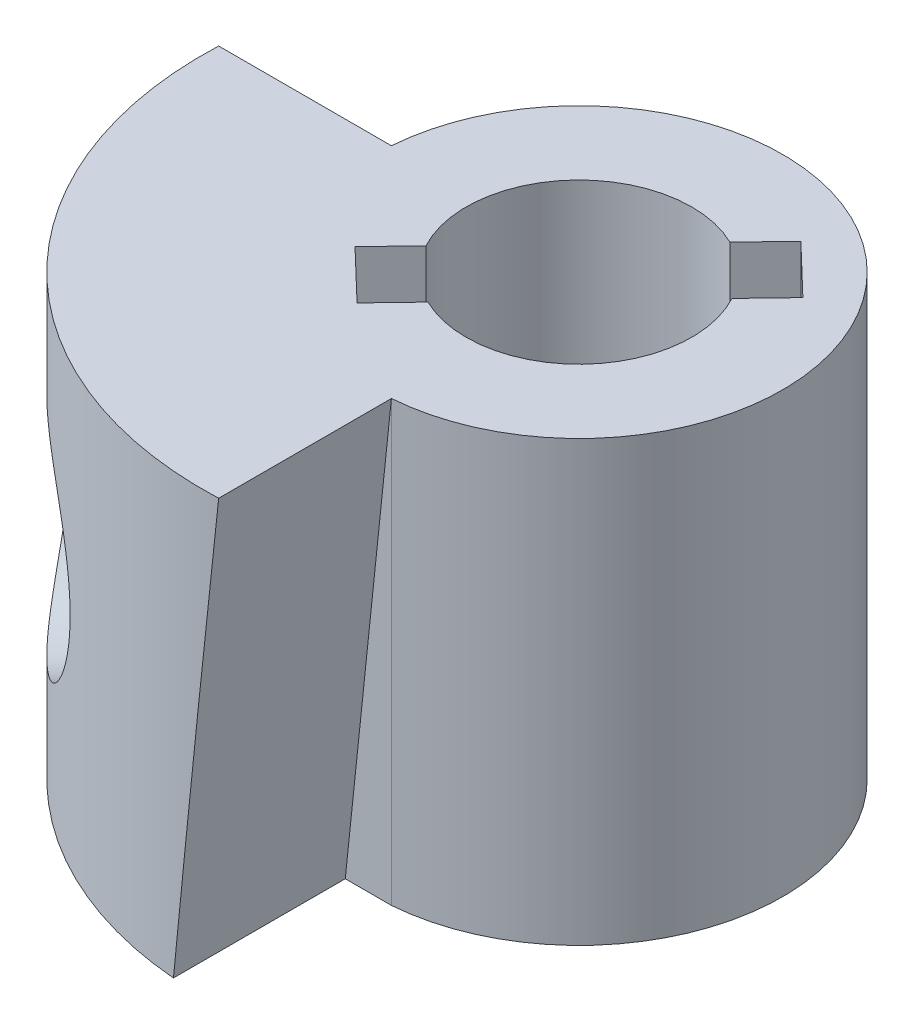
ISO-10303-21;
HEADER;
FILE_DESCRIPTION(('STEP AP214'),'2;1');
FILE_NAME('part.step','',(''),(''),'','','');
FILE_SCHEMA(('AUTOMOTIVE_DESIGN { 1 0 10303 214 1 1 1 1 }'));
ENDSEC;
DATA;
#1=APPLICATION_CONTEXT('core data for automotive mechanical design processes');
#2=APPLICATION_PROTOCOL_DEFINITION('international standard','automotive_design',2000,#1);
#3=PRODUCT_CONTEXT('',#1,'mechanical');
#4=PRODUCT('Part','Part','',(#3));
#5=PRODUCT_RELATED_PRODUCT_CATEGORY('part','',(#4));
#6=PRODUCT_DEFINITION_FORMATION('','',#4);
#7=PRODUCT_DEFINITION_CONTEXT('part definition',#1,'design');
#8=PRODUCT_DEFINITION('design','',#6,#7);
#9=PRODUCT_DEFINITION_SHAPE('','',#8);
#10=(LENGTH_UNIT() NAMED_UNIT(*) SI_UNIT(.MILLI.,.METRE.));
#11=(NAMED_UNIT(*) PLANE_ANGLE_UNIT() SI_UNIT($,.RADIAN.));
#12=(NAMED_UNIT(*) SI_UNIT($,.STERADIAN.) SOLID_ANGLE_UNIT());
#13=UNCERTAINTY_MEASURE_WITH_UNIT(LENGTH_MEASURE(1.E-05),#10,'distance_accuracy_value','');
#14=(GEOMETRIC_REPRESENTATION_CONTEXT(3) GLOBAL_UNCERTAINTY_ASSIGNED_CONTEXT((#13)) GLOBAL_UNIT_ASSIGNED_CONTEXT((#10,
#11,#12)) REPRESENTATION_CONTEXT('',''));
#15=CARTESIAN_POINT('',(0.,0.,0.));
#16=DIRECTION('',(0.,0.,1.));
#17=DIRECTION('',(1.,0.,0.));
#18=AXIS2_PLACEMENT_3D('',#15,#16,#17);
#19=CARTESIAN_POINT('',(0.,0.,0.));
#20=DIRECTION('',(0.,1.,0.));
#21=DIRECTION('',(0.,0.,1.));
#22=AXIS2_PLACEMENT_3D('',#19,#20,#21);
#23=PLANE('',#22);
#24=CARTESIAN_POINT('',(3.1978546756018,0.,-6.44686874327543));
#25=DIRECTION('',(0.,1.,0.));
#26=DIRECTION('',(0.,0.,1.));
#27=AXIS2_PLACEMENT_3D('',#24,#25,#26);
#28=CIRCLE('',#27,6.);
#29=CARTESIAN_POINT('',(2.71212502874212,0.,-0.4665621700167));
#30=VERTEX_POINT('',#29);
#31=CARTESIAN_POINT('',(-2.75710614179532,0.,-5.71308290035869));
#32=VERTEX_POINT('',#31);
#33=EDGE_CURVE('E190',#30,#32,#28,.F.);
#34=ORIENTED_EDGE('',*,*,#33,.T.);
#35=DIRECTION('',(1.,0.,0.));
#36=VECTOR('',#35,1.);
#37=CARTESIAN_POINT('',(-3.7969347285391,0.,-5.71308290035869));
#38=LINE('',#37,#36);
#39=CARTESIAN_POINT('',(-0.0425156736021293,0.,-5.71308290035869));
#40=VERTEX_POINT('',#39);
#41=EDGE_CURVE('E271',#32,#40,#38,.T.);
#42=ORIENTED_EDGE('',*,*,#41,.T.);
#43=DIRECTION('',(0.,0.,-1.));
#44=VECTOR('',#43,1.);
#45=CARTESIAN_POINT('',(-0.0425156736021293,0.,-6.69686874327543));
#46=LINE('',#45,#44);
#47=CARTESIAN_POINT('',(-0.0425156736021293,0.,-6.69686874327543));
#48=VERTEX_POINT('',#47);
#49=EDGE_CURVE('E233',#40,#48,#46,.T.);
#50=ORIENTED_EDGE('',*,*,#49,.T.);
#51=CARTESIAN_POINT('',(3.1978546756018,0.,-6.44686874327543));
#52=DIRECTION('',(0.,1.,0.));
#53=DIRECTION('',(0.,0.,1.));
#54=AXIS2_PLACEMENT_3D('',#51,#52,#53);
#55=CIRCLE('',#54,3.25);
#56=CARTESIAN_POINT('',(3.4478546756018,0.,-3.2064983940715));
#57=VERTEX_POINT('',#56);
#58=EDGE_CURVE('E195',#57,#48,#55,.T.);
#59=ORIENTED_EDGE('',*,*,#58,.F.);
#60=DIRECTION('',(1.,0.,0.));
#61=VECTOR('',#60,1.);
#62=CARTESIAN_POINT('',(3.4478546756018,0.,-3.2064983940715));
#63=LINE('',#62,#61);
#64=CARTESIAN_POINT('',(2.71212502874212,0.,-3.2064983940715));
#65=VERTEX_POINT('',#64);
#66=EDGE_CURVE('E277',#65,#57,#63,.T.);
#67=ORIENTED_EDGE('',*,*,#66,.F.);
#68=DIRECTION('',(0.,0.,-1.));
#69=VECTOR('',#68,1.);
#70=CARTESIAN_POINT('',(2.71212502874212,0.,0.));
#71=LINE('',#70,#69);
#72=EDGE_CURVE('E221',#30,#65,#71,.T.);
#73=ORIENTED_EDGE('',*,*,#72,.F.);
#74=EDGE_LOOP('',(#34,#42,#50,#59,#67,#73));
#75=FACE_BOUND('',#74,.T.);
#76=CARTESIAN_POINT('',(3.1978546756018,0.,-6.44686874327543));
#77=DIRECTION('',(0.,1.,0.));
#78=DIRECTION('',(0.,0.,1.));
#79=AXIS2_PLACEMENT_3D('',#76,#77,#78);
#80=CIRCLE('',#79,1.8);
#81=CARTESIAN_POINT('',(3.98742463542605,0.,-8.06445313938685));
#82=VERTEX_POINT('',#81);
#83=CARTESIAN_POINT('',(1.61447294149998,0.,-5.59077162021479));
#84=VERTEX_POINT('',#83);
#85=EDGE_CURVE('E214',#82,#84,#80,.T.);
#86=ORIENTED_EDGE('',*,*,#85,.T.);
#87=DIRECTION('',(0.692261157318882,0.,-0.721647067525062));
#88=VECTOR('',#87,1.);
#89=CARTESIAN_POINT('',(-1.95219558295705,0.,-1.87270098416041));
#90=LINE('',#89,#88);
#91=CARTESIAN_POINT('',(1.06066401564487,0.,-5.01345396619473));
#92=VERTEX_POINT('',#91);
#93=EDGE_CURVE('E170',#92,#84,#90,.T.);
#94=ORIENTED_EDGE('',*,*,#93,.F.);
#95=DIRECTION('',(-0.721647067525063,0.,-0.692261157318882));
#96=VECTOR('',#95,1.);
#97=CARTESIAN_POINT('',(3.01285959860192,0.,-3.14075298203433));
#98=LINE('',#97,#96);
#99=CARTESIAN_POINT('',(1.85447578992245,0.,-4.25196669314396));
#100=VERTEX_POINT('',#99);
#101=EDGE_CURVE('E608',#100,#92,#98,.T.);
#102=ORIENTED_EDGE('',*,*,#101,.F.);
#103=DIRECTION('',(-0.692261157318881,0.,0.721647067525063));
#104=VECTOR('',#103,1.);
#105=CARTESIAN_POINT('',(-1.15838380867947,0.,-1.11121371110963));
#106=LINE('',#105,#104);
#107=CARTESIAN_POINT('',(2.40828471577755,0.,-4.82928434716401));
#108=VERTEX_POINT('',#107);
#109=EDGE_CURVE('E566',#108,#100,#106,.T.);
#110=ORIENTED_EDGE('',*,*,#109,.F.);
#111=CARTESIAN_POINT('',(4.78123640970362,0.,-7.30296586633608));
#112=VERTEX_POINT('',#111);
#113=EDGE_CURVE('E211',#108,#112,#80,.T.);
#114=ORIENTED_EDGE('',*,*,#113,.T.);
#115=DIRECTION('',(0.692261157318882,0.,-0.721647067525062));
#116=VECTOR('',#115,1.);
#117=CARTESIAN_POINT('',(-1.15838380867948,0.,-1.11121371110964));
#118=LINE('',#117,#116);
#119=CARTESIAN_POINT('',(5.33504533555872,0.,-7.88028352035612));
#120=VERTEX_POINT('',#119);
#121=EDGE_CURVE('E552',#112,#120,#118,.T.);
#122=ORIENTED_EDGE('',*,*,#121,.T.);
#123=DIRECTION('',(-0.72164706752506,0.,-0.692261157318884));
#124=VECTOR('',#123,1.);
#125=CARTESIAN_POINT('',(6.49342914423822,0.,-6.76906980924646));
#126=LINE('',#125,#124);
#127=CARTESIAN_POINT('',(4.54123356128116,0.,-8.6417707934069));
#128=VERTEX_POINT('',#127);
#129=EDGE_CURVE('E546',#120,#128,#126,.T.);
#130=ORIENTED_EDGE('',*,*,#129,.T.);
#131=DIRECTION('',(-0.692261157318882,0.,0.721647067525063));
#132=VECTOR('',#131,1.);
#133=CARTESIAN_POINT('',(-1.95219558295705,0.,-1.8727009841604));
#134=LINE('',#133,#132);
#135=EDGE_CURVE('E553',#128,#82,#134,.T.);
#136=ORIENTED_EDGE('',*,*,#135,.T.);
#137=EDGE_LOOP('',(#86,#94,#102,#110,#114,#122,#130,#136));
#138=FACE_BOUND('',#137,.T.);
#139=ADVANCED_FACE('F39',(#75,#138),#23,.F.);
#140=CARTESIAN_POINT('',(3.1978546756018,7.,-6.44686874327543));
#141=DIRECTION('',(0.,-1.,0.));
#142=DIRECTION('',(0.,0.,-1.));
#143=AXIS2_PLACEMENT_3D('',#140,#141,#142);
#144=CYLINDRICAL_SURFACE('',#143,1.8);
#145=DIRECTION('',(0.,-1.,0.));
#146=VECTOR('',#145,1.);
#147=CARTESIAN_POINT('',(1.61447294149998,7.,-5.59077162021479));
#148=LINE('',#147,#146);
#149=CARTESIAN_POINT('',(1.61447294149998,2.68434316709461,-5.59077162021479));
#150=VERTEX_POINT('',#149);
#151=EDGE_CURVE('E577',#150,#84,#148,.T.);
#152=ORIENTED_EDGE('',*,*,#151,.T.);
#153=ORIENTED_EDGE('',*,*,#85,.F.);
#154=DIRECTION('',(0.,-1.,0.));
#155=VECTOR('',#154,1.);
#156=CARTESIAN_POINT('',(3.98742463542605,7.,-8.06445313938685));
#157=LINE('',#156,#155);
#158=CARTESIAN_POINT('',(3.98742463542605,7.,-8.06445313938685));
#159=VERTEX_POINT('',#158);
#160=EDGE_CURVE('E564',#159,#82,#157,.T.);
#161=ORIENTED_EDGE('',*,*,#160,.F.);
#162=CARTESIAN_POINT('',(3.1978546756018,7.,-6.44686874327543));
#163=DIRECTION('',(0.,1.,0.));
#164=DIRECTION('',(0.,0.,1.));
#165=AXIS2_PLACEMENT_3D('',#162,#163,#164);
#166=CIRCLE('',#165,1.8);
#167=CARTESIAN_POINT('',(1.61447294149998,7.,-5.59077162021479));
#168=VERTEX_POINT('',#167);
#169=EDGE_CURVE('E189',#159,#168,#166,.T.);
#170=ORIENTED_EDGE('',*,*,#169,.T.);
#171=CARTESIAN_POINT('',(1.61447294149998,4.3156568329054,-5.59077162021479));
#172=VERTEX_POINT('',#171);
#173=EDGE_CURVE('E572',#168,#172,#148,.T.);
#174=ORIENTED_EDGE('',*,*,#173,.T.);
#175=CARTESIAN_POINT('',(2.58593626434302,3.5,-4.75407346387437));
#176=CARTESIAN_POINT('',(2.58593165890067,3.45164209567553,-4.75407304253641));
#177=CARTESIAN_POINT('',(2.58189518822979,3.40322669557676,-4.75551743004544));
#178=CARTESIAN_POINT('',(2.56604689302456,3.30781980538129,-4.76137584568503));
#179=CARTESIAN_POINT('',(2.55421983771715,3.26083129351047,-4.76579569127817));
#180=CARTESIAN_POINT('',(2.52369222374452,3.16978646138646,-4.77780592866989));
#181=CARTESIAN_POINT('',(2.5050177543581,3.12571975162445,-4.78538430097502));
#182=CARTESIAN_POINT('',(2.46190275726425,3.04132444139148,-4.80402837477698));
#183=CARTESIAN_POINT('',(2.43746217748379,3.00099587468382,-4.81509410776802));
#184=CARTESIAN_POINT('',(2.38253180949395,2.92277910530327,-4.84180486423292));
#185=CARTESIAN_POINT('',(2.35178356271122,2.88514647255107,-4.85766795969881));
#186=CARTESIAN_POINT('',(2.28660946116589,2.81579594789013,-4.89412119419213));
#187=CARTESIAN_POINT('',(2.25218282067698,2.78407932366381,-4.91471234424314));
#188=CARTESIAN_POINT('',(2.18036583194011,2.72683694507191,-4.96141006006465));
#189=CARTESIAN_POINT('',(2.14292760750474,2.70145931333166,-4.98762590827676));
#190=CARTESIAN_POINT('',(2.06747934349972,2.65874518423221,-5.04526320224414));
#191=CARTESIAN_POINT('',(2.02946972323656,2.64140306165042,-5.07668098543121));
#192=CARTESIAN_POINT('',(1.95747843572969,2.61644399113628,-5.14163430969477));
#193=CARTESIAN_POINT('',(1.92340984082619,2.60818951007556,-5.17482880316509));
#194=CARTESIAN_POINT('',(1.85759237638962,2.5993885241676,-5.24437709028566));
#195=CARTESIAN_POINT('',(1.82584282218836,2.59883973508447,-5.28072994447232));
#196=CARTESIAN_POINT('',(1.76729303187841,2.60511955998636,-5.35345273840576));
#197=CARTESIAN_POINT('',(1.74031920572765,2.61155657178351,-5.38971852193239));
#198=CARTESIAN_POINT('',(1.68988787715863,2.63078373203864,-5.4629907195175));
#199=CARTESIAN_POINT('',(1.66643107954017,2.6435751516877,-5.49999728034536));
#200=CARTESIAN_POINT('',(1.6221058536884,2.67578231161031,-5.57564101172271));
#201=CARTESIAN_POINT('',(1.60143812627157,2.6955107381739,-5.61426171910763));
#202=CARTESIAN_POINT('',(1.56414372744641,2.74072421621793,-5.6900493448843));
#203=CARTESIAN_POINT('',(1.54751882365155,2.76621177635935,-5.72721562142856));
#204=CARTESIAN_POINT('',(1.51627171011049,2.82570043316487,-5.80331319402689));
#205=CARTESIAN_POINT('',(1.5021215466589,2.86035301070488,-5.84193023363628));
#206=CARTESIAN_POINT('',(1.47793807132945,2.93552420798308,-5.91455753528682));
#207=CARTESIAN_POINT('',(1.4679097259891,2.97604982534678,-5.94856220686187));
#208=CARTESIAN_POINT('',(1.45086159076688,3.06485794555923,-6.01195229026397));
#209=CARTESIAN_POINT('',(1.44404636057603,3.11345129266112,-6.04096292036509));
#210=CARTESIAN_POINT('',(1.4335506068992,3.21552216811336,-6.08930537082033));
#211=CARTESIAN_POINT('',(1.42986287060364,3.26898814152932,-6.10865941903924));
#212=CARTESIAN_POINT('',(1.425317058196,3.37125681986916,-6.13342305703632));
#213=CARTESIAN_POINT('',(1.42413417624729,3.41965907769657,-6.14040995745534));
#214=CARTESIAN_POINT('',(1.42341215773127,3.51688599288063,-6.14460821931317));
#215=CARTESIAN_POINT('',(1.42387168901975,3.56571027588346,-6.14182750319509));
#216=CARTESIAN_POINT('',(1.42630748441873,3.65438851618388,-6.12803527157906));
#217=CARTESIAN_POINT('',(1.42803958521473,3.69446712608628,-6.11835553809088));
#218=CARTESIAN_POINT('',(1.43292044598403,3.77261191084303,-6.09307172218272));
#219=CARTESIAN_POINT('',(1.43606977202725,3.81067727476814,-6.07746527289553));
#220=CARTESIAN_POINT('',(1.44436433785688,3.88712362440158,-6.03984329495438));
#221=CARTESIAN_POINT('',(1.44964978000072,3.92528357984879,-6.01741312686864));
#222=CARTESIAN_POINT('',(1.46254521585249,3.99806299434809,-5.96795893948852));
#223=CARTESIAN_POINT('',(1.47015651151187,4.03268045588064,-5.9409323510064));
#224=CARTESIAN_POINT('',(1.48977280538416,4.10419236669426,-5.87788792990748));
#225=CARTESIAN_POINT('',(1.50233503053165,4.14028979442872,-5.84113514341304));
#226=CARTESIAN_POINT('',(1.5318694500142,4.20643596571868,-5.76408186939672));
#227=CARTESIAN_POINT('',(1.54884482629075,4.23648031706685,-5.72377883601885));
#228=CARTESIAN_POINT('',(1.58906121385059,4.29168195925882,-5.6380553166008));
#229=CARTESIAN_POINT('',(1.61266435409063,4.31633402951735,-5.59247512890515));
#230=CARTESIAN_POINT('',(1.66566450826141,4.35669317230296,-5.50072385364523));
#231=CARTESIAN_POINT('',(1.69505607083561,4.37240860735328,-5.45455335997765));
#232=CARTESIAN_POINT('',(1.75616189589581,4.39283454357759,-5.36795308129152));
#233=CARTESIAN_POINT('',(1.78738993676058,4.39844899221216,-5.3273947351398));
#234=CARTESIAN_POINT('',(1.85336554362842,4.4009890764757,-5.24896725790613));
#235=CARTESIAN_POINT('',(1.88811070584326,4.39792060832638,-5.21109631981743));
#236=CARTESIAN_POINT('',(1.9560854793894,4.38383684485589,-5.14299437851764));
#237=CARTESIAN_POINT('',(1.98910828587971,4.37366390002721,-5.11237810969817));
#238=CARTESIAN_POINT('',(2.05570640540849,4.34661984929305,-5.05495252931959));
#239=CARTESIAN_POINT('',(2.08928173970136,4.32974848513566,-5.0281433645943));
#240=CARTESIAN_POINT('',(2.15604257981551,4.28967938394721,-4.97840788278078));
#241=CARTESIAN_POINT('',(2.18922238660323,4.26642934564628,-4.95551632450452));
#242=CARTESIAN_POINT('',(2.25371670332376,4.21431991579325,-4.91387192484171));
#243=CARTESIAN_POINT('',(2.28503061013679,4.18545872324531,-4.8951204164128));
#244=CARTESIAN_POINT('',(2.34711111304475,4.12022513267222,-4.86017205225501));
#245=CARTESIAN_POINT('',(2.37762382947284,4.08343164168241,-4.84430922221613));
#246=CARTESIAN_POINT('',(2.43380434392032,4.00486235528098,-4.81677406662317));
#247=CARTESIAN_POINT('',(2.45946837662002,3.9630827285543,-4.80510499150106));
#248=CARTESIAN_POINT('',(2.50555870135343,3.87357196165791,-4.78512685302997));
#249=CARTESIAN_POINT('',(2.52571163785091,3.8256619419721,-4.77698424477482));
#250=CARTESIAN_POINT('',(2.55779122805544,3.72677338472121,-4.76442358829717));
#251=CARTESIAN_POINT('',(2.56973914450205,3.67580315352015,-4.75999590643936));
#252=CARTESIAN_POINT('',(2.58003963849306,3.60361561655101,-4.75621462103034));
#253=CARTESIAN_POINT('',(2.58224645603788,3.58296609919506,-4.7554110909343));
#254=CARTESIAN_POINT('',(2.58519577874893,3.54154792875828,-4.75434059543721));
#255=CARTESIAN_POINT('',(2.58593824329025,3.52077927238826,-4.75407364492225));
#256=CARTESIAN_POINT('',(2.58593626434302,3.5,-4.75407346387437));
#257=B_SPLINE_CURVE_WITH_KNOTS('',3,(#175,#176,#177,#178,#179,#180,#181,#182,#183,#184,#185,
#186,#187,#188,#189,#190,#191,#192,#193,#194,#195,#196,#197,#198,#199,#200,#201,#202,#203,#204,
#205,#206,#207,#208,#209,#210,#211,#212,#213,#214,#215,#216,#217,#218,#219,#220,#221,#222,#223,
#224,#225,#226,#227,#228,#229,#230,#231,#232,#233,#234,#235,#236,#237,#238,#239,#240,#241,#242,
#243,#244,#245,#246,#247,#248,#249,#250,#251,#252,#253,#254,#255,#256),.UNSPECIFIED.,.T.,.F.,(4,
2,2,2,2,2,2,2,2,2,2,2,2,2,2,2,2,2,2,2,2,2,2,2,2,2,2,2,2,2,2,2,2,2,2,2,2,2,2,2,4),(0.,
0.144990043783322,0.290264391114628,0.434990885686945,0.579718687316227,0.732392956177553,
0.8850999025959,1.04109728162934,1.1969852897815,1.34105684449336,1.48508569046908,
1.62143886843484,1.75781933466851,1.90136405746522,2.04497142885722,2.20562708960415,
2.36647576702449,2.53651179476386,2.7061546007186,2.8519592420929,2.99764564969445,
3.12092374360412,3.24425112117317,3.37750136000473,3.51082632586766,3.66923593789059,
3.82776008368537,3.99765667891288,4.16739402940341,4.32099975785357,4.47450120382963,
4.61234819214932,4.7502004955599,4.88921874799706,5.02828169460252,5.17870970479738,
5.32925405628246,5.48628555882566,5.64290857376971,5.70520871014841,5.76751057486826),.UNSPECIFIED.);
#258=EDGE_CURVE('E234',#150,#172,#257,.T.);
#259=ORIENTED_EDGE('',*,*,#258,.F.);
#260=EDGE_LOOP('',(#152,#153,#161,#170,#174,#259));
#261=FACE_BOUND('',#260,.T.);
#262=ADVANCED_FACE('F41',(#261),#144,.F.);
#263=DIRECTION('',(0.,-1.,0.));
#264=VECTOR('',#263,1.);
#265=CARTESIAN_POINT('',(2.40828471577755,7.,-4.82928434716401));
#266=LINE('',#265,#264);
#267=CARTESIAN_POINT('',(2.40828471577755,7.,-4.82928434716401));
#268=VERTEX_POINT('',#267);
#269=CARTESIAN_POINT('',(2.40828471577756,4.04053534302425,-4.82928434716401));
#270=VERTEX_POINT('',#269);
#271=EDGE_CURVE('E161',#268,#270,#266,.T.);
#272=ORIENTED_EDGE('',*,*,#271,.F.);
#273=CARTESIAN_POINT('',(4.78123640970362,7.,-7.30296586633608));
#274=VERTEX_POINT('',#273);
#275=EDGE_CURVE('E177',#268,#274,#166,.T.);
#276=ORIENTED_EDGE('',*,*,#275,.T.);
#277=DIRECTION('',(0.,-1.,0.));
#278=VECTOR('',#277,1.);
#279=CARTESIAN_POINT('',(4.78123640970362,7.,-7.30296586633608));
#280=LINE('',#279,#278);
#281=EDGE_CURVE('E567',#274,#112,#280,.T.);
#282=ORIENTED_EDGE('',*,*,#281,.T.);
#283=ORIENTED_EDGE('',*,*,#113,.F.);
#284=CARTESIAN_POINT('',(2.40828471577755,2.95946465697574,-4.82928434716401));
#285=VERTEX_POINT('',#284);
#286=EDGE_CURVE('E181',#285,#108,#266,.T.);
#287=ORIENTED_EDGE('',*,*,#286,.F.);
#288=EDGE_CURVE('E180',#270,#285,#257,.T.);
#289=ORIENTED_EDGE('',*,*,#288,.F.);
#290=EDGE_LOOP('',(#272,#276,#282,#283,#287,#289));
#291=FACE_BOUND('',#290,.T.);
#292=ADVANCED_FACE('F175',(#291),#144,.F.);
#293=CARTESIAN_POINT('',(0.,7.,0.));
#294=DIRECTION('',(0.,1.,0.));
#295=DIRECTION('',(0.,0.,1.));
#296=AXIS2_PLACEMENT_3D('',#293,#294,#295);
#297=PLANE('',#296);
#298=DIRECTION('',(0.692261157318882,0.,-0.721647067525062));
#299=VECTOR('',#298,1.);
#300=CARTESIAN_POINT('',(-1.95219558295705,7.,-1.87270098416041));
#301=LINE('',#300,#299);
#302=CARTESIAN_POINT('',(1.06066401564487,7.,-5.01345396619473));
#303=VERTEX_POINT('',#302);
#304=EDGE_CURVE('E604',#303,#168,#301,.T.);
#305=ORIENTED_EDGE('',*,*,#304,.T.);
#306=ORIENTED_EDGE('',*,*,#169,.F.);
#307=DIRECTION('',(-0.692261157318882,0.,0.721647067525063));
#308=VECTOR('',#307,1.);
#309=CARTESIAN_POINT('',(-1.95219558295705,7.,-1.8727009841604));
#310=LINE('',#309,#308);
#311=CARTESIAN_POINT('',(4.54123356128116,7.,-8.6417707934069));
#312=VERTEX_POINT('',#311);
#313=EDGE_CURVE('E558',#312,#159,#310,.T.);
#314=ORIENTED_EDGE('',*,*,#313,.F.);
#315=DIRECTION('',(-0.72164706752506,0.,-0.692261157318884));
#316=VECTOR('',#315,1.);
#317=CARTESIAN_POINT('',(6.49342914423822,7.,-6.76906980924646));
#318=LINE('',#317,#316);
#319=CARTESIAN_POINT('',(5.33504533555872,7.,-7.88028352035612));
#320=VERTEX_POINT('',#319);
#321=EDGE_CURVE('E560',#320,#312,#318,.T.);
#322=ORIENTED_EDGE('',*,*,#321,.F.);
#323=DIRECTION('',(0.692261157318882,0.,-0.721647067525062));
#324=VECTOR('',#323,1.);
#325=CARTESIAN_POINT('',(-1.15838380867948,7.,-1.11121371110964));
#326=LINE('',#325,#324);
#327=EDGE_CURVE('E188',#274,#320,#326,.T.);
#328=ORIENTED_EDGE('',*,*,#327,.F.);
#329=ORIENTED_EDGE('',*,*,#275,.F.);
#330=DIRECTION('',(-0.692261157318881,0.,0.721647067525063));
#331=VECTOR('',#330,1.);
#332=CARTESIAN_POINT('',(-1.15838380867947,7.,-1.11121371110963));
#333=LINE('',#332,#331);
#334=CARTESIAN_POINT('',(1.85447578992245,7.,-4.25196669314396));
#335=VERTEX_POINT('',#334);
#336=EDGE_CURVE('E158',#268,#335,#333,.T.);
#337=ORIENTED_EDGE('',*,*,#336,.T.);
#338=DIRECTION('',(-0.721647067525063,0.,-0.692261157318882));
#339=VECTOR('',#338,1.);
#340=CARTESIAN_POINT('',(3.01285959860192,7.,-3.14075298203433));
#341=LINE('',#340,#339);
#342=EDGE_CURVE('E169',#335,#303,#341,.T.);
#343=ORIENTED_EDGE('',*,*,#342,.T.);
#344=EDGE_LOOP('',(#305,#306,#314,#322,#328,#329,#337,#343));
#345=FACE_BOUND('',#344,.T.);
#346=DIRECTION('',(0.,0.,1.));
#347=VECTOR('',#346,1.);
#348=CARTESIAN_POINT('',(3.4478546756018,7.,0.));
#349=LINE('',#348,#347);
#350=CARTESIAN_POINT('',(3.4478546756018,7.,-3.2064983940715));
#351=VERTEX_POINT('',#350);
#352=CARTESIAN_POINT('',(3.4478546756018,7.,-0.45207933913453));
#353=VERTEX_POINT('',#352);
#354=EDGE_CURVE('E193',#351,#353,#349,.T.);
#355=ORIENTED_EDGE('',*,*,#354,.F.);
#356=CARTESIAN_POINT('',(3.1978546756018,7.,-6.44686874327543));
#357=DIRECTION('',(0.,1.,0.));
#358=DIRECTION('',(0.,0.,1.));
#359=AXIS2_PLACEMENT_3D('',#356,#357,#358);
#360=CIRCLE('',#359,3.25);
#361=CARTESIAN_POINT('',(-0.0425156736021293,7.,-6.69686874327543));
#362=VERTEX_POINT('',#361);
#363=EDGE_CURVE('E202',#351,#362,#360,.T.);
#364=ORIENTED_EDGE('',*,*,#363,.T.);
#365=DIRECTION('',(1.,0.,0.));
#366=VECTOR('',#365,1.);
#367=CARTESIAN_POINT('',(0.,7.,-6.69686874327543));
#368=LINE('',#367,#366);
#369=CARTESIAN_POINT('',(-2.7969347285391,7.,-6.69686874327543));
#370=VERTEX_POINT('',#369);
#371=EDGE_CURVE('E205',#370,#362,#368,.T.);
#372=ORIENTED_EDGE('',*,*,#371,.F.);
#373=CARTESIAN_POINT('',(3.1978546756018,7.,-6.44686874327543));
#374=DIRECTION('',(0.,1.,0.));
#375=DIRECTION('',(0.,0.,1.));
#376=AXIS2_PLACEMENT_3D('',#373,#374,#375);
#377=CIRCLE('',#376,6.);
#378=EDGE_CURVE('E207',#353,#370,#377,.F.);
#379=ORIENTED_EDGE('',*,*,#378,.F.);
#380=EDGE_LOOP('',(#355,#364,#372,#379));
#381=FACE_BOUND('',#380,.T.);
#382=ADVANCED_FACE('F185',(#345,#381),#297,.T.);
#383=CARTESIAN_POINT('',(3.1978546756018,7.,-6.44686874327543));
#384=DIRECTION('',(0.,-1.,0.));
#385=DIRECTION('',(0.,0.,-1.));
#386=AXIS2_PLACEMENT_3D('',#383,#384,#385);
#387=CYLINDRICAL_SURFACE('',#386,6.);
#388=CARTESIAN_POINT('',(0.384462744056485,3.5,-1.14735689410331));
#389=CARTESIAN_POINT('',(0.384461139480891,3.59917357594385,-1.14735704170312));
#390=CARTESIAN_POINT('',(0.376903978071228,3.69835970483848,-1.15134882574909));
#391=CARTESIAN_POINT('',(0.347094579851536,3.89384917804654,-1.16733799084028));
#392=CARTESIAN_POINT('',(0.324837643469319,3.99015159012902,-1.17933793213567));
#393=CARTESIAN_POINT('',(0.266856513807776,4.17703291080018,-1.211380576223));
#394=CARTESIAN_POINT('',(0.231151315374851,4.26761968266237,-1.23141193768804));
#395=CARTESIAN_POINT('',(0.147990970470655,4.44088687865349,-1.27960332644498));
#396=CARTESIAN_POINT('',(0.100534304414148,4.52356627835994,-1.30776440507081));
#397=CARTESIAN_POINT('',(-0.00532791241932071,4.68083553698675,-1.37305654735561));
#398=CARTESIAN_POINT('',(-0.0639667403666316,4.75518661958033,-1.41038477205143));
#399=CARTESIAN_POINT('',(-0.189012164077003,4.89155240888357,-1.49361075192342));
#400=CARTESIAN_POINT('',(-0.255419391723757,4.9535661109579,-1.53950920438547));
#401=CARTESIAN_POINT('',(-0.394348102587145,5.06425341250621,-1.64025602826767));
#402=CARTESIAN_POINT('',(-0.46693796854537,5.11274270035341,-1.69521320441209));
#403=CARTESIAN_POINT('',(-0.614673888009603,5.19374598041238,-1.8129146820025));
#404=CARTESIAN_POINT('',(-0.689819351036889,5.22626363646434,-1.87565719337738));
#405=CARTESIAN_POINT('',(-0.837644323768661,5.27350250119773,-2.00568116573199));
#406=CARTESIAN_POINT('',(-0.910331024950413,5.28872168394947,-2.0727734625509));
#407=CARTESIAN_POINT('',(-1.05304798744662,5.30257552727147,-2.21133907677854));
#408=CARTESIAN_POINT('',(-1.12307868925765,5.30121295009303,-2.28281166252878));
#409=CARTESIAN_POINT('',(-1.25667207482228,5.28228178435839,-2.42610415454518));
#410=CARTESIAN_POINT('',(-1.32035455467111,5.26512958523709,-2.49786817576724));
#411=CARTESIAN_POINT('',(-1.44178228854006,5.21585195070968,-2.64126725254904));
#412=CARTESIAN_POINT('',(-1.499526958233,5.18372504339253,-2.71290229473602));
#413=CARTESIAN_POINT('',(-1.609148490288,5.10477748112989,-2.85508112051683));
#414=CARTESIAN_POINT('',(-1.66089209397784,5.0576876994985,-2.9255778720717));
#415=CARTESIAN_POINT('',(-1.75665805941324,4.9503617164805,-3.06164545016315));
#416=CARTESIAN_POINT('',(-1.80067835096447,4.89012200000206,-3.12721495329159));
#417=CARTESIAN_POINT('',(-1.88242942649275,4.75524286855195,-3.25365410744826));
#418=CARTESIAN_POINT('',(-1.91982320537776,4.68010944704606,-3.31421560741767));
#419=CARTESIAN_POINT('',(-1.98594183879989,4.51907179630009,-3.42487929946316));
#420=CARTESIAN_POINT('',(-2.01466597729136,4.4331666782296,-3.47498062750415));
#421=CARTESIAN_POINT('',(-2.06360958045726,4.25231184867183,-3.56250888805849));
#422=CARTESIAN_POINT('',(-2.08378698251283,4.15732016142132,-3.59987296254334));
#423=CARTESIAN_POINT('',(-2.11547163145516,3.96133451634627,-3.65944761979588));
#424=CARTESIAN_POINT('',(-2.12698245903554,3.860343056024,-3.68166446045639));
#425=CARTESIAN_POINT('',(-2.14103165836039,3.66027953348295,-3.70889192355113));
#426=CARTESIAN_POINT('',(-2.14396328878438,3.56133746791373,-3.71465637628076));
#427=CARTESIAN_POINT('',(-2.1419814073863,3.3638443012866,-3.71078459198854));
#428=CARTESIAN_POINT('',(-2.13706913429853,3.26529314095952,-3.70115078670856));
#429=CARTESIAN_POINT('',(-2.1196628609737,3.07445163419096,-3.66759852312612));
#430=CARTESIAN_POINT('',(-2.10740110793758,2.98206214307322,-3.64411798121102));
#431=CARTESIAN_POINT('',(-2.0754733506219,2.80281890292688,-3.58450127283381));
#432=CARTESIAN_POINT('',(-2.0558060925833,2.71596609417692,-3.54836296347196));
#433=CARTESIAN_POINT('',(-2.00827741129386,2.54719605642652,-3.46381561470009));
#434=CARTESIAN_POINT('',(-1.9801742402688,2.46552520987257,-3.41505138598803));
#435=CARTESIAN_POINT('',(-1.915996129475,2.31214530994101,-3.3080125711601));
#436=CARTESIAN_POINT('',(-1.87991895315135,2.24043906064958,-3.24973531802552));
#437=CARTESIAN_POINT('',(-1.79794783178736,2.10556115026724,-3.12303025555185));
#438=CARTESIAN_POINT('',(-1.75167383865087,2.04294511235835,-3.05425530322784));
#439=CARTESIAN_POINT('',(-1.65068998777759,1.93216609383831,-2.91144046819698));
#440=CARTESIAN_POINT('',(-1.59598015446487,1.88400307138292,-2.83740060073384));
#441=CARTESIAN_POINT('',(-1.47893762825277,1.80374692880968,-2.68699350976089));
#442=CARTESIAN_POINT('',(-1.41662397921506,1.7716146473536,-2.61063244615163));
#443=CARTESIAN_POINT('',(-1.2855158978076,1.72444523581367,-2.45819996549237));
#444=CARTESIAN_POINT('',(-1.21672347783967,1.70940281620748,-2.38212846608798));
#445=CARTESIAN_POINT('',(-1.07747189273136,1.69730919737664,-2.23600792093123));
#446=CARTESIAN_POINT('',(-1.00719935735647,1.69953958294967,-2.16583991867036));
#447=CARTESIAN_POINT('',(-0.864536573382479,1.72028107403123,-2.0302341741455));
#448=CARTESIAN_POINT('',(-0.792146533825091,1.73879057766101,-1.96479596715133));
#449=CARTESIAN_POINT('',(-0.648978154787613,1.79100268881893,-1.84136567016746));
#450=CARTESIAN_POINT('',(-0.578194400710891,1.8244235869944,-1.78326003566041));
#451=CARTESIAN_POINT('',(-0.439279428440516,1.90535134810047,-1.67412671882122));
#452=CARTESIAN_POINT('',(-0.371148566315608,1.95286009456702,-1.62309998427317));
#453=CARTESIAN_POINT('',(-0.238152602670287,2.06206228124495,-1.5274433382405));
#454=CARTESIAN_POINT('',(-0.173420715176636,2.12409625709778,-1.48301722179586));
#455=CARTESIAN_POINT('',(-0.0516269758445565,2.25997329675646,-1.40244487916246));
#456=CARTESIAN_POINT('',(0.00543280827171165,2.33381953241016,-1.36630088326174));
#457=CARTESIAN_POINT('',(0.111157372541063,2.4938488149231,-1.30135884447738));
#458=CARTESIAN_POINT('',(0.15951879472032,2.58033560753848,-1.27281383379671));
#459=CARTESIAN_POINT('',(0.243386754446364,2.76157261432771,-1.22446740053242));
#460=CARTESIAN_POINT('',(0.27889856975709,2.85631941595077,-1.20466238740336));
#461=CARTESIAN_POINT('',(0.332457103388654,3.04181229203806,-1.1752146110743));
#462=CARTESIAN_POINT('',(0.351877871098003,3.132035583718,-1.16476404686949));
#463=CARTESIAN_POINT('',(0.377880378819179,3.3148358644535,-1.15083569604476));
#464=CARTESIAN_POINT('',(0.384464242073501,3.40741246170236,-1.14735675630548));
#465=CARTESIAN_POINT('',(0.384462744056485,3.5,-1.14735689410331));
#466=B_SPLINE_CURVE_WITH_KNOTS('',3,(#388,#389,#390,#391,#392,#393,#394,#395,#396,#397,#398,
#399,#400,#401,#402,#403,#404,#405,#406,#407,#408,#409,#410,#411,#412,#413,#414,#415,#416,#417,
#418,#419,#420,#421,#422,#423,#424,#425,#426,#427,#428,#429,#430,#431,#432,#433,#434,#435,#436,
#437,#438,#439,#440,#441,#442,#443,#444,#445,#446,#447,#448,#449,#450,#451,#452,#453,#454,#455,
#456,#457,#458,#459,#460,#461,#462,#463,#464,#465),.UNSPECIFIED.,.T.,.F.,(4,2,2,2,2,2,2,2,2,2,2,
2,2,2,2,2,2,2,2,2,2,2,2,2,2,2,2,2,2,2,2,2,2,2,2,2,2,2,4),(0.,0.29718130911136,0.594457674202237,
0.891315719703268,1.18821217205687,1.49216024583185,1.7961330600371,2.10406585442596,
2.41192797700727,2.71068339566266,3.00938904720962,3.30043640831719,3.59151238341762,
3.88815215328215,4.18487131484607,4.49390959062024,4.80297338360002,5.11354103691697,
5.42398030516309,5.71994765313639,6.01586826562284,6.30289719608281,6.58997474267926,
6.88622526859417,7.18255899275814,7.49274462076764,7.80292935072185,8.1123525770126,
8.42168000689775,8.71821308840526,9.01471699407504,9.30584202513077,9.59700599697264,
9.8958360418389,10.1947464641723,10.5026280950734,10.8103831247455,11.0878747628549,
11.3653204995526),.UNSPECIFIED.);
#467=CARTESIAN_POINT('',(0.384462744056485,3.5,-1.14735689410331));
#468=VERTEX_POINT('',#467);
#469=EDGE_CURVE('E225',#468,#468,#466,.T.);
#470=ORIENTED_EDGE('',*,*,#469,.F.);
#471=EDGE_LOOP('',(#470));
#472=FACE_BOUND('',#471,.T.);
#473=CARTESIAN_POINT('',(3.1978546756018,5.22115756940395,-6.44686874327543));
#474=DIRECTION('',(0.,0.139173100960066,0.99026806874157));
#475=DIRECTION('',(0.,-0.99026806874157,0.139173100960066));
#476=AXIS2_PLACEMENT_3D('',#473,#474,#475);
#477=ELLIPSE('',#476,43.1117792059662,6.);
#478=EDGE_CURVE('E274',#32,#370,#477,.F.);
#479=ORIENTED_EDGE('',*,*,#478,.F.);
#480=ORIENTED_EDGE('',*,*,#33,.F.);
#481=CARTESIAN_POINT('',(3.1978546756018,4.62140888644418,-6.44686874327543));
#482=DIRECTION('',(0.994521895368274,-0.104528463267646,0.));
#483=DIRECTION('',(-0.104528463267646,-0.994521895368274,0.));
#484=AXIS2_PLACEMENT_3D('',#481,#482,#483);
#485=ELLIPSE('',#484,57.4006334010376,6.);
#486=EDGE_CURVE('E199',#30,#353,#485,.F.);
#487=ORIENTED_EDGE('',*,*,#486,.T.);
#488=ORIENTED_EDGE('',*,*,#378,.T.);
#489=EDGE_LOOP('',(#479,#480,#487,#488));
#490=FACE_BOUND('',#489,.T.);
#491=ADVANCED_FACE('F235',(#472,#490),#387,.T.);
#492=CARTESIAN_POINT('',(3.1978546756018,7.,-6.44686874327543));
#493=DIRECTION('',(0.,-1.,0.));
#494=DIRECTION('',(0.,0.,-1.));
#495=AXIS2_PLACEMENT_3D('',#492,#493,#494);
#496=CYLINDRICAL_SURFACE('',#495,3.25);
#497=ORIENTED_EDGE('',*,*,#58,.T.);
#498=DIRECTION('',(0.,-1.,0.));
#499=VECTOR('',#498,1.);
#500=CARTESIAN_POINT('',(-0.0425156736021293,7.,-6.69686874327543));
#501=LINE('',#500,#499);
#502=EDGE_CURVE('E210',#362,#48,#501,.T.);
#503=ORIENTED_EDGE('',*,*,#502,.F.);
#504=ORIENTED_EDGE('',*,*,#363,.F.);
#505=DIRECTION('',(0.,-1.,0.));
#506=VECTOR('',#505,1.);
#507=CARTESIAN_POINT('',(3.4478546756018,7.,-3.2064983940715));
#508=LINE('',#507,#506);
#509=EDGE_CURVE('E218',#351,#57,#508,.T.);
#510=ORIENTED_EDGE('',*,*,#509,.T.);
#511=EDGE_LOOP('',(#497,#503,#504,#510));
#512=FACE_BOUND('',#511,.T.);
#513=ADVANCED_FACE('F303',(#512),#496,.T.);
#514=CARTESIAN_POINT('',(2.71212502874212,0.,0.54792066086547));
#515=DIRECTION('',(0.994521895368274,-0.104528463267646,0.));
#516=DIRECTION('',(0.104528463267646,0.994521895368274,0.));
#517=AXIS2_PLACEMENT_3D('',#514,#515,#516);
#518=PLANE('',#517);
#519=ORIENTED_EDGE('',*,*,#72,.T.);
#520=DIRECTION('',(-0.104528463267646,-0.994521895368274,0.));
#521=VECTOR('',#520,1.);
#522=CARTESIAN_POINT('',(2.71212502874212,0.,-3.2064983940715));
#523=LINE('',#522,#521);
#524=EDGE_CURVE('E276',#351,#65,#523,.T.);
#525=ORIENTED_EDGE('',*,*,#524,.F.);
#526=ORIENTED_EDGE('',*,*,#354,.T.);
#527=ORIENTED_EDGE('',*,*,#486,.F.);
#528=EDGE_LOOP('',(#519,#525,#526,#527));
#529=FACE_BOUND('',#528,.T.);
#530=ADVANCED_FACE('F300',(#529),#518,.T.);
#531=CARTESIAN_POINT('',(0.,0.,-3.2064983940715));
#532=DIRECTION('',(0.,0.,-1.));
#533=DIRECTION('',(-1.,0.,0.));
#534=AXIS2_PLACEMENT_3D('',#531,#532,#533);
#535=PLANE('',#534);
#536=ORIENTED_EDGE('',*,*,#509,.F.);
#537=ORIENTED_EDGE('',*,*,#524,.T.);
#538=ORIENTED_EDGE('',*,*,#66,.T.);
#539=EDGE_LOOP('',(#536,#537,#538));
#540=FACE_BOUND('',#539,.T.);
#541=ADVANCED_FACE('F301',(#540),#535,.F.);
#542=CARTESIAN_POINT('',(-3.7969347285391,0.,-5.71308290035869));
#543=DIRECTION('',(0.,0.139173100960066,0.99026806874157));
#544=DIRECTION('',(0.,-0.99026806874157,0.139173100960066));
#545=AXIS2_PLACEMENT_3D('',#542,#543,#544);
#546=PLANE('',#545);
#547=ORIENTED_EDGE('',*,*,#478,.T.);
#548=ORIENTED_EDGE('',*,*,#371,.T.);
#549=DIRECTION('',(0.,-0.99026806874157,0.139173100960066));
#550=VECTOR('',#549,1.);
#551=CARTESIAN_POINT('',(-0.0425156736021293,0.,-5.71308290035869));
#552=LINE('',#551,#550);
#553=EDGE_CURVE('E269',#362,#40,#552,.T.);
#554=ORIENTED_EDGE('',*,*,#553,.T.);
#555=ORIENTED_EDGE('',*,*,#41,.F.);
#556=EDGE_LOOP('',(#547,#548,#554,#555));
#557=FACE_BOUND('',#556,.T.);
#558=ADVANCED_FACE('F294',(#557),#546,.F.);
#559=CARTESIAN_POINT('',(-0.0425156736021293,0.,0.));
#560=DIRECTION('',(-1.,0.,0.));
#561=DIRECTION('',(0.,0.,1.));
#562=AXIS2_PLACEMENT_3D('',#559,#560,#561);
#563=PLANE('',#562);
#564=ORIENTED_EDGE('',*,*,#49,.F.);
#565=ORIENTED_EDGE('',*,*,#553,.F.);
#566=ORIENTED_EDGE('',*,*,#502,.T.);
#567=EDGE_LOOP('',(#564,#565,#566));
#568=FACE_BOUND('',#567,.T.);
#569=ADVANCED_FACE('F255',(#568),#563,.T.);
#570=CARTESIAN_POINT('',(-3.55929347836868,3.5,0.374484882683687));
#571=DIRECTION('',(-0.690843182130559,0.,0.723004631868789));
#572=DIRECTION('',(0.723004631868789,0.,0.690843182130559));
#573=AXIS2_PLACEMENT_3D('',#570,#571,#572);
#574=CYLINDRICAL_SURFACE('',#573,0.899999999999998);
#575=CARTESIAN_POINT('',(1.20752447833218,3.5,-4.61424707721096));
#576=DIRECTION('',(-0.690843182130559,0.,0.723004631868789));
#577=DIRECTION('',(0.723004631868789,0.,0.690843182130559));
#578=AXIS2_PLACEMENT_3D('',#575,#576,#577);
#579=CIRCLE('',#578,0.899999999999998);
#580=CARTESIAN_POINT('',(1.85822864701409,3.5,-3.99248821329346));
#581=VERTEX_POINT('',#580);
#582=EDGE_CURVE('E265',#581,#581,#579,.T.);
#583=ORIENTED_EDGE('',*,*,#582,.T.);
#584=EDGE_LOOP('',(#583));
#585=FACE_BOUND('',#584,.T.);
#586=ORIENTED_EDGE('',*,*,#258,.T.);
#587=CARTESIAN_POINT('',(135.759652923386,3.5,-145.430302891153));
#588=DIRECTION('',(-0.721647067525062,0.,-0.692261157318882));
#589=DIRECTION('',(-0.692261157318882,0.,0.721647067525062));
#590=AXIS2_PLACEMENT_3D('',#587,#588,#589);
#591=ELLIPSE('',#590,458.466337342674,0.899999999999998);
#592=CARTESIAN_POINT('',(1.06066401564487,4.31492257470926,-5.01345396619473));
#593=VERTEX_POINT('',#592);
#594=EDGE_CURVE('E11',#172,#593,#591,.F.);
#595=ORIENTED_EDGE('',*,*,#594,.T.);
#596=CARTESIAN_POINT('',(1.33631218704011,3.5,-4.74903035702337));
#597=DIRECTION('',(-0.692261157318882,0.,0.721647067525063));
#598=DIRECTION('',(0.721647067525063,0.,0.692261157318882));
#599=AXIS2_PLACEMENT_3D('',#596,#597,#598);
#600=ELLIPSE('',#599,0.900001734138901,0.899999999999998);
#601=CARTESIAN_POINT('',(1.85447578992245,4.04261973931942,-4.25196669314396));
#602=VERTEX_POINT('',#601);
#603=EDGE_CURVE('E48',#593,#602,#600,.F.);
#604=ORIENTED_EDGE('',*,*,#603,.T.);
#605=CARTESIAN_POINT('',(-251.352766775192,3.5,259.703712664801));
#606=DIRECTION('',(0.721647067525063,0.,0.692261157318881));
#607=DIRECTION('',(-0.692261157318881,0.,0.721647067525063));
#608=AXIS2_PLACEMENT_3D('',#605,#606,#607);
#609=ELLIPSE('',#608,458.466337343089,0.899999999999998);
#610=EDGE_CURVE('E601',#602,#270,#609,.F.);
#611=ORIENTED_EDGE('',*,*,#610,.T.);
#612=ORIENTED_EDGE('',*,*,#288,.T.);
#613=CARTESIAN_POINT('',(1.85447578992245,2.95738026068059,-4.25196669314396));
#614=VERTEX_POINT('',#613);
#615=EDGE_CURVE('E224',#285,#614,#609,.F.);
#616=ORIENTED_EDGE('',*,*,#615,.T.);
#617=CARTESIAN_POINT('',(1.06066401564487,2.68507742529074,-5.01345396619473));
#618=VERTEX_POINT('',#617);
#619=EDGE_CURVE('E600',#614,#618,#600,.F.);
#620=ORIENTED_EDGE('',*,*,#619,.T.);
#621=EDGE_CURVE('E43',#618,#150,#591,.F.);
#622=ORIENTED_EDGE('',*,*,#621,.T.);
#623=EDGE_LOOP('',(#586,#595,#604,#611,#612,#616,#620,#622));
#624=FACE_BOUND('',#623,.T.);
#625=ADVANCED_FACE('F250',(#585,#624),#574,.F.);
#626=CARTESIAN_POINT('',(0.585765614414676,3.5,-3.96354290852905));
#627=DIRECTION('',(-0.690843182130559,0.,0.723004631868789));
#628=DIRECTION('',(0.723004631868789,0.,0.690843182130559));
#629=AXIS2_PLACEMENT_3D('',#626,#627,#628);
#630=CONICAL_SURFACE('',#629,1.8,0.785398163397447);
#631=ORIENTED_EDGE('',*,*,#582,.F.);
#632=EDGE_LOOP('',(#631));
#633=FACE_BOUND('',#632,.T.);
#634=CARTESIAN_POINT('',(0.585765614414676,3.5,-3.96354290852905));
#635=DIRECTION('',(-0.690843182130559,0.,0.723004631868789));
#636=DIRECTION('',(0.723004631868789,0.,0.690843182130559));
#637=AXIS2_PLACEMENT_3D('',#634,#635,#636);
#638=CIRCLE('',#637,1.8);
#639=CARTESIAN_POINT('',(1.8871739517785,3.5,-2.72002518069404));
#640=VERTEX_POINT('',#639);
#641=EDGE_CURVE('E570',#640,#640,#638,.T.);
#642=ORIENTED_EDGE('',*,*,#641,.T.);
#643=EDGE_LOOP('',(#642));
#644=FACE_BOUND('',#643,.T.);
#645=ADVANCED_FACE('F244',(#633,#644),#630,.F.);
#646=CARTESIAN_POINT('',(-3.55929347836868,3.5,0.374484882683687));
#647=DIRECTION('',(-0.690843182130559,0.,0.723004631868789));
#648=DIRECTION('',(0.723004631868789,0.,0.690843182130559));
#649=AXIS2_PLACEMENT_3D('',#646,#647,#648);
#650=CYLINDRICAL_SURFACE('',#649,1.8);
#651=ORIENTED_EDGE('',*,*,#469,.T.);
#652=EDGE_LOOP('',(#651));
#653=FACE_BOUND('',#652,.T.);
#654=ORIENTED_EDGE('',*,*,#641,.F.);
#655=EDGE_LOOP('',(#654));
#656=FACE_BOUND('',#655,.T.);
#657=ADVANCED_FACE('F238',(#653,#656),#650,.F.);
#658=CARTESIAN_POINT('',(-1.15838380867947,7.,-1.11121371110963));
#659=DIRECTION('',(0.721647067525063,0.,0.692261157318881));
#660=DIRECTION('',(0.692261157318881,0.,-0.721647067525063));
#661=AXIS2_PLACEMENT_3D('',#658,#659,#660);
#662=PLANE('',#661);
#663=ORIENTED_EDGE('',*,*,#286,.T.);
#664=ORIENTED_EDGE('',*,*,#109,.T.);
#665=DIRECTION('',(0.,-1.,0.));
#666=VECTOR('',#665,1.);
#667=CARTESIAN_POINT('',(1.85447578992245,7.,-4.25196669314396));
#668=LINE('',#667,#666);
#669=EDGE_CURVE('E63',#614,#100,#668,.T.);
#670=ORIENTED_EDGE('',*,*,#669,.F.);
#671=ORIENTED_EDGE('',*,*,#615,.F.);
#672=EDGE_LOOP('',(#663,#664,#670,#671));
#673=FACE_BOUND('',#672,.T.);
#674=ADVANCED_FACE('F243',(#673),#662,.F.);
#675=CARTESIAN_POINT('',(3.01285959860192,7.,-3.14075298203433));
#676=DIRECTION('',(-0.692261157318882,0.,0.721647067525063));
#677=DIRECTION('',(0.721647067525063,0.,0.692261157318882));
#678=AXIS2_PLACEMENT_3D('',#675,#676,#677);
#679=PLANE('',#678);
#680=ORIENTED_EDGE('',*,*,#669,.T.);
#681=ORIENTED_EDGE('',*,*,#101,.T.);
#682=DIRECTION('',(0.,-1.,0.));
#683=VECTOR('',#682,1.);
#684=CARTESIAN_POINT('',(1.06066401564487,7.,-5.01345396619473));
#685=LINE('',#684,#683);
#686=EDGE_CURVE('E588',#618,#92,#685,.T.);
#687=ORIENTED_EDGE('',*,*,#686,.F.);
#688=ORIENTED_EDGE('',*,*,#619,.F.);
#689=EDGE_LOOP('',(#680,#681,#687,#688));
#690=FACE_BOUND('',#689,.T.);
#691=ADVANCED_FACE('F347',(#690),#679,.F.);
#692=CARTESIAN_POINT('',(-1.95219558295705,7.,-1.87270098416041));
#693=DIRECTION('',(-0.721647067525062,0.,-0.692261157318882));
#694=DIRECTION('',(-0.692261157318882,0.,0.721647067525062));
#695=AXIS2_PLACEMENT_3D('',#692,#693,#694);
#696=PLANE('',#695);
#697=ORIENTED_EDGE('',*,*,#686,.T.);
#698=ORIENTED_EDGE('',*,*,#93,.T.);
#699=ORIENTED_EDGE('',*,*,#151,.F.);
#700=ORIENTED_EDGE('',*,*,#621,.F.);
#701=EDGE_LOOP('',(#697,#698,#699,#700));
#702=FACE_BOUND('',#701,.T.);
#703=ADVANCED_FACE('F354',(#702),#696,.F.);
#704=ORIENTED_EDGE('',*,*,#173,.F.);
#705=ORIENTED_EDGE('',*,*,#304,.F.);
#706=EDGE_CURVE('E582',#303,#593,#685,.T.);
#707=ORIENTED_EDGE('',*,*,#706,.T.);
#708=ORIENTED_EDGE('',*,*,#594,.F.);
#709=EDGE_LOOP('',(#704,#705,#707,#708));
#710=FACE_BOUND('',#709,.T.);
#711=ADVANCED_FACE('F363',(#710),#696,.F.);
#712=ORIENTED_EDGE('',*,*,#706,.F.);
#713=ORIENTED_EDGE('',*,*,#342,.F.);
#714=EDGE_CURVE('E164',#335,#602,#668,.T.);
#715=ORIENTED_EDGE('',*,*,#714,.T.);
#716=ORIENTED_EDGE('',*,*,#603,.F.);
#717=EDGE_LOOP('',(#712,#713,#715,#716));
#718=FACE_BOUND('',#717,.T.);
#719=ADVANCED_FACE('F357',(#718),#679,.F.);
#720=ORIENTED_EDGE('',*,*,#714,.F.);
#721=ORIENTED_EDGE('',*,*,#336,.F.);
#722=ORIENTED_EDGE('',*,*,#271,.T.);
#723=ORIENTED_EDGE('',*,*,#610,.F.);
#724=EDGE_LOOP('',(#720,#721,#722,#723));
#725=FACE_BOUND('',#724,.T.);
#726=ADVANCED_FACE('F160',(#725),#662,.F.);
#727=CARTESIAN_POINT('',(-1.95219558295705,7.,-1.8727009841604));
#728=DIRECTION('',(0.721647067525063,0.,0.692261157318882));
#729=DIRECTION('',(0.692261157318882,0.,-0.721647067525063));
#730=AXIS2_PLACEMENT_3D('',#727,#728,#729);
#731=PLANE('',#730);
#732=ORIENTED_EDGE('',*,*,#135,.F.);
#733=DIRECTION('',(0.,-1.,0.));
#734=VECTOR('',#733,1.);
#735=CARTESIAN_POINT('',(4.54123356128116,7.,-8.6417707934069));
#736=LINE('',#735,#734);
#737=EDGE_CURVE('E549',#312,#128,#736,.T.);
#738=ORIENTED_EDGE('',*,*,#737,.F.);
#739=ORIENTED_EDGE('',*,*,#313,.T.);
#740=ORIENTED_EDGE('',*,*,#160,.T.);
#741=EDGE_LOOP('',(#732,#738,#739,#740));
#742=FACE_BOUND('',#741,.T.);
#743=ADVANCED_FACE('F246',(#742),#731,.T.);
#744=CARTESIAN_POINT('',(-1.15838380867948,7.,-1.11121371110964));
#745=DIRECTION('',(-0.721647067525062,0.,-0.692261157318882));
#746=DIRECTION('',(-0.692261157318882,0.,0.721647067525062));
#747=AXIS2_PLACEMENT_3D('',#744,#745,#746);
#748=PLANE('',#747);
#749=ORIENTED_EDGE('',*,*,#121,.F.);
#750=ORIENTED_EDGE('',*,*,#281,.F.);
#751=ORIENTED_EDGE('',*,*,#327,.T.);
#752=DIRECTION('',(0.,-1.,0.));
#753=VECTOR('',#752,1.);
#754=CARTESIAN_POINT('',(5.33504533555872,7.,-7.88028352035612));
#755=LINE('',#754,#753);
#756=EDGE_CURVE('E55',#320,#120,#755,.T.);
#757=ORIENTED_EDGE('',*,*,#756,.T.);
#758=EDGE_LOOP('',(#749,#750,#751,#757));
#759=FACE_BOUND('',#758,.T.);
#760=ADVANCED_FACE('F388',(#759),#748,.T.);
#761=CARTESIAN_POINT('',(6.49342914423822,7.,-6.76906980924646));
#762=DIRECTION('',(-0.692261157318884,0.,0.72164706752506));
#763=DIRECTION('',(0.72164706752506,0.,0.692261157318884));
#764=AXIS2_PLACEMENT_3D('',#761,#762,#763);
#765=PLANE('',#764);
#766=ORIENTED_EDGE('',*,*,#129,.F.);
#767=ORIENTED_EDGE('',*,*,#756,.F.);
#768=ORIENTED_EDGE('',*,*,#321,.T.);
#769=ORIENTED_EDGE('',*,*,#737,.T.);
#770=EDGE_LOOP('',(#766,#767,#768,#769));
#771=FACE_BOUND('',#770,.T.);
#772=ADVANCED_FACE('F395',(#771),#765,.T.);
#773=CLOSED_SHELL('',(#139,#262,#292,#382,#491,#513,#530,#541,#558,#569,#625,#645,#657,#674,
#691,#703,#711,#719,#726,#743,#760,#772));
#774=MANIFOLD_SOLID_BREP('B2',#773);
#775=ADVANCED_BREP_SHAPE_REPRESENTATION('',(#18,#774),#14);
#776=SHAPE_DEFINITION_REPRESENTATION(#9,#775);
ENDSEC;
END-ISO-10303-21;
